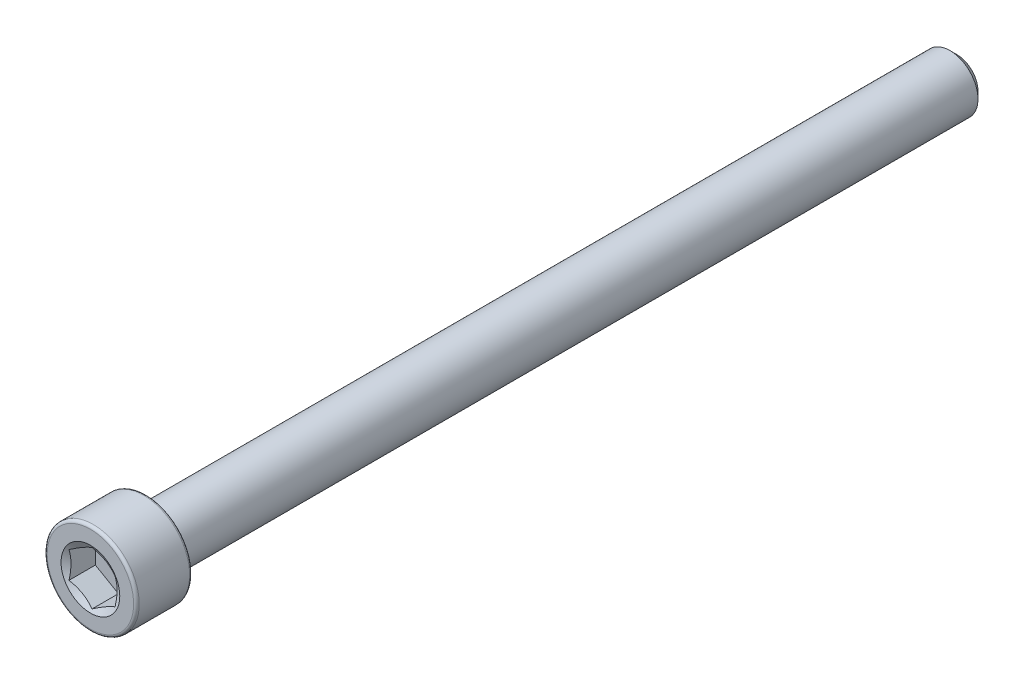
ISO-10303-21;
HEADER;
FILE_DESCRIPTION(('STEP AP214'),'2;1');
FILE_NAME('part.step','',(''),(''),'','','');
FILE_SCHEMA(('AUTOMOTIVE_DESIGN { 1 0 10303 214 1 1 1 1 }'));
ENDSEC;
DATA;
#1=APPLICATION_CONTEXT('core data for automotive mechanical design processes');
#2=APPLICATION_PROTOCOL_DEFINITION('international standard','automotive_design',2000,#1);
#3=PRODUCT_CONTEXT('',#1,'mechanical');
#4=PRODUCT('Part','Part','',(#3));
#5=PRODUCT_RELATED_PRODUCT_CATEGORY('part','',(#4));
#6=PRODUCT_DEFINITION_FORMATION('','',#4);
#7=PRODUCT_DEFINITION_CONTEXT('part definition',#1,'design');
#8=PRODUCT_DEFINITION('design','',#6,#7);
#9=PRODUCT_DEFINITION_SHAPE('','',#8);
#10=(LENGTH_UNIT() NAMED_UNIT(*) SI_UNIT(.MILLI.,.METRE.));
#11=(NAMED_UNIT(*) PLANE_ANGLE_UNIT() SI_UNIT($,.RADIAN.));
#12=(NAMED_UNIT(*) SI_UNIT($,.STERADIAN.) SOLID_ANGLE_UNIT());
#13=UNCERTAINTY_MEASURE_WITH_UNIT(LENGTH_MEASURE(1.E-05),#10,'distance_accuracy_value','');
#14=(GEOMETRIC_REPRESENTATION_CONTEXT(3) GLOBAL_UNCERTAINTY_ASSIGNED_CONTEXT((#13)) GLOBAL_UNIT_ASSIGNED_CONTEXT((#10,
#11,#12)) REPRESENTATION_CONTEXT('',''));
#15=CARTESIAN_POINT('',(0.,0.,0.));
#16=DIRECTION('',(0.,0.,1.));
#17=DIRECTION('',(1.,0.,0.));
#18=AXIS2_PLACEMENT_3D('',#15,#16,#17);
#19=CARTESIAN_POINT('',(0.,0.,-37.338));
#20=DIRECTION('',(0.,0.,-1.));
#21=DIRECTION('',(-1.,0.,0.));
#22=AXIS2_PLACEMENT_3D('',#19,#20,#21);
#23=PLANE('',#22);
#24=CARTESIAN_POINT('',(0.,0.,-37.338));
#25=DIRECTION('',(0.,0.,-1.));
#26=DIRECTION('',(-1.,0.,0.));
#27=AXIS2_PLACEMENT_3D('',#24,#25,#26);
#28=CIRCLE('',#27,1.81768750000002);
#29=CARTESIAN_POINT('',(-1.81768750000002,0.,-37.338));
#30=VERTEX_POINT('',#29);
#31=EDGE_CURVE('E50',#30,#30,#28,.T.);
#32=ORIENTED_EDGE('',*,*,#31,.T.);
#33=EDGE_LOOP('',(#32));
#34=FACE_BOUND('',#33,.T.);
#35=ADVANCED_FACE('F37',(#34),#23,.T.);
#36=CARTESIAN_POINT('',(0.,0.,-37.338));
#37=DIRECTION('',(0.,0.,1.));
#38=DIRECTION('',(1.,0.,0.));
#39=AXIS2_PLACEMENT_3D('',#36,#37,#38);
#40=CONICAL_SURFACE('',#39,1.81768750000002,0.785398163397449);
#41=CARTESIAN_POINT('',(0.,0.,-36.7426875));
#42=DIRECTION('',(0.,0.,-1.));
#43=DIRECTION('',(-1.,0.,0.));
#44=AXIS2_PLACEMENT_3D('',#41,#42,#43);
#45=CIRCLE('',#44,2.41300000000002);
#46=CARTESIAN_POINT('',(-2.41300000000002,0.,-36.7426875));
#47=VERTEX_POINT('',#46);
#48=EDGE_CURVE('E135',#47,#47,#45,.T.);
#49=ORIENTED_EDGE('',*,*,#48,.T.);
#50=EDGE_LOOP('',(#49));
#51=FACE_BOUND('',#50,.T.);
#52=ORIENTED_EDGE('',*,*,#31,.F.);
#53=EDGE_LOOP('',(#52));
#54=FACE_BOUND('',#53,.T.);
#55=ADVANCED_FACE('F141',(#51,#54),#40,.T.);
#56=CARTESIAN_POINT('',(0.,0.,-37.338));
#57=DIRECTION('',(0.,0.,-1.));
#58=DIRECTION('',(-1.,0.,0.));
#59=AXIS2_PLACEMENT_3D('',#56,#57,#58);
#60=CYLINDRICAL_SURFACE('',#59,2.41300000000002);
#61=CARTESIAN_POINT('',(0.,0.,32.512));
#62=DIRECTION('',(0.,0.,-1.));
#63=DIRECTION('',(-1.,0.,0.));
#64=AXIS2_PLACEMENT_3D('',#61,#62,#63);
#65=CIRCLE('',#64,2.41300000000002);
#66=CARTESIAN_POINT('',(-2.41300000000002,0.,32.512));
#67=VERTEX_POINT('',#66);
#68=EDGE_CURVE('E132',#67,#67,#65,.T.);
#69=ORIENTED_EDGE('',*,*,#68,.T.);
#70=EDGE_LOOP('',(#69));
#71=FACE_BOUND('',#70,.T.);
#72=ORIENTED_EDGE('',*,*,#48,.F.);
#73=EDGE_LOOP('',(#72));
#74=FACE_BOUND('',#73,.T.);
#75=ADVANCED_FACE('F143',(#71,#74),#60,.T.);
#76=CARTESIAN_POINT('',(0.,2.413,32.512));
#77=DIRECTION('',(0.,0.,-1.));
#78=DIRECTION('',(-1.,0.,0.));
#79=AXIS2_PLACEMENT_3D('',#76,#77,#78);
#80=PLANE('',#79);
#81=CARTESIAN_POINT('',(0.,0.,32.512));
#82=DIRECTION('',(0.,0.,-1.));
#83=DIRECTION('',(-1.,0.,0.));
#84=AXIS2_PLACEMENT_3D('',#81,#82,#83);
#85=CIRCLE('',#84,3.72745);
#86=CARTESIAN_POINT('',(-3.72745,0.,32.512));
#87=VERTEX_POINT('',#86);
#88=EDGE_CURVE('E129',#87,#87,#85,.T.);
#89=ORIENTED_EDGE('',*,*,#88,.T.);
#90=EDGE_LOOP('',(#89));
#91=FACE_BOUND('',#90,.T.);
#92=ORIENTED_EDGE('',*,*,#68,.F.);
#93=EDGE_LOOP('',(#92));
#94=FACE_BOUND('',#93,.T.);
#95=ADVANCED_FACE('F149',(#91,#94),#80,.T.);
#96=CARTESIAN_POINT('',(0.,0.,32.7533));
#97=DIRECTION('',(0.,0.,-1.));
#98=DIRECTION('',(-1.,0.,0.));
#99=AXIS2_PLACEMENT_3D('',#96,#97,#98);
#100=TOROIDAL_SURFACE('',#99,3.72745,0.241299999999999);
#101=CARTESIAN_POINT('',(0.,0.,32.7533));
#102=DIRECTION('',(0.,0.,-1.));
#103=DIRECTION('',(-1.,0.,0.));
#104=AXIS2_PLACEMENT_3D('',#101,#102,#103);
#105=CIRCLE('',#104,3.96875);
#106=CARTESIAN_POINT('',(-3.96875,0.,32.7533));
#107=VERTEX_POINT('',#106);
#108=EDGE_CURVE('E126',#107,#107,#105,.T.);
#109=ORIENTED_EDGE('',*,*,#108,.T.);
#110=EDGE_LOOP('',(#109));
#111=FACE_BOUND('',#110,.T.);
#112=ORIENTED_EDGE('',*,*,#88,.F.);
#113=EDGE_LOOP('',(#112));
#114=FACE_BOUND('',#113,.T.);
#115=ADVANCED_FACE('F155',(#111,#114),#100,.T.);
#116=CARTESIAN_POINT('',(0.,0.,-37.338));
#117=DIRECTION('',(0.,0.,-1.));
#118=DIRECTION('',(-1.,0.,0.));
#119=AXIS2_PLACEMENT_3D('',#116,#117,#118);
#120=CYLINDRICAL_SURFACE('',#119,3.96875);
#121=CARTESIAN_POINT('',(0.,0.,37.0967));
#122=DIRECTION('',(0.,0.,-1.));
#123=DIRECTION('',(-1.,0.,0.));
#124=AXIS2_PLACEMENT_3D('',#121,#122,#123);
#125=CIRCLE('',#124,3.96875);
#126=CARTESIAN_POINT('',(-3.96875,0.,37.0967));
#127=VERTEX_POINT('',#126);
#128=EDGE_CURVE('E123',#127,#127,#125,.T.);
#129=ORIENTED_EDGE('',*,*,#128,.T.);
#130=EDGE_LOOP('',(#129));
#131=FACE_BOUND('',#130,.T.);
#132=ORIENTED_EDGE('',*,*,#108,.F.);
#133=EDGE_LOOP('',(#132));
#134=FACE_BOUND('',#133,.T.);
#135=ADVANCED_FACE('F159',(#131,#134),#120,.T.);
#136=CARTESIAN_POINT('',(0.,0.,37.0967));
#137=DIRECTION('',(0.,0.,-1.));
#138=DIRECTION('',(-1.,0.,0.));
#139=AXIS2_PLACEMENT_3D('',#136,#137,#138);
#140=TOROIDAL_SURFACE('',#139,3.72745,0.2413);
#141=CARTESIAN_POINT('',(0.,0.,37.338));
#142=DIRECTION('',(0.,0.,-1.));
#143=DIRECTION('',(-1.,0.,0.));
#144=AXIS2_PLACEMENT_3D('',#141,#142,#143);
#145=CIRCLE('',#144,3.72745);
#146=CARTESIAN_POINT('',(-3.72745,0.,37.338));
#147=VERTEX_POINT('',#146);
#148=EDGE_CURVE('E120',#147,#147,#145,.T.);
#149=ORIENTED_EDGE('',*,*,#148,.T.);
#150=EDGE_LOOP('',(#149));
#151=FACE_BOUND('',#150,.T.);
#152=ORIENTED_EDGE('',*,*,#128,.F.);
#153=EDGE_LOOP('',(#152));
#154=FACE_BOUND('',#153,.T.);
#155=ADVANCED_FACE('F163',(#151,#154),#140,.T.);
#156=CARTESIAN_POINT('',(0.,3.72744999999999,37.338));
#157=DIRECTION('',(0.,0.,1.));
#158=DIRECTION('',(1.,0.,0.));
#159=AXIS2_PLACEMENT_3D('',#156,#157,#158);
#160=PLANE('',#159);
#161=CARTESIAN_POINT('',(0.,0.,37.338));
#162=DIRECTION('',(0.,0.,1.));
#163=DIRECTION('',(1.,0.,0.));
#164=AXIS2_PLACEMENT_3D('',#161,#162,#163);
#165=CIRCLE('',#164,2.53070740070526);
#166=CARTESIAN_POINT('',(2.53070740070526,0.,37.338));
#167=VERTEX_POINT('',#166);
#168=EDGE_CURVE('E257',#167,#167,#165,.T.);
#169=ORIENTED_EDGE('',*,*,#168,.F.);
#170=EDGE_LOOP('',(#169));
#171=FACE_BOUND('',#170,.T.);
#172=ORIENTED_EDGE('',*,*,#148,.F.);
#173=EDGE_LOOP('',(#172));
#174=FACE_BOUND('',#173,.T.);
#175=ADVANCED_FACE('F167',(#171,#174),#160,.T.);
#176=CARTESIAN_POINT('',(0.,0.,37.338));
#177=DIRECTION('',(0.,0.,1.));
#178=DIRECTION('',(1.,0.,0.));
#179=AXIS2_PLACEMENT_3D('',#176,#177,#178);
#180=CONICAL_SURFACE('',#179,2.53070740070526,1.0471975511966);
#181=ORIENTED_EDGE('',*,*,#168,.T.);
#182=EDGE_LOOP('',(#181));
#183=FACE_BOUND('',#182,.T.);
#184=CARTESIAN_POINT('',(1.98457499999999,1.14556397036932,37.1998787393351));
#185=CARTESIAN_POINT('',(1.89737036121931,1.19591159204392,37.1707977498695));
#186=CARTESIAN_POINT('',(1.80941298069499,1.24669380936685,37.1443492756564));
#187=CARTESIAN_POINT('',(1.63197502132767,1.34913766297204,37.0981823388358));
#188=CARTESIAN_POINT('',(1.54249128874367,1.4008011200675,37.0784802098783));
#189=CARTESIAN_POINT('',(1.36463285198752,1.50348773640631,37.0478097995608));
#190=CARTESIAN_POINT('',(1.2762855196939,1.55449509248822,37.0366374103495));
#191=CARTESIAN_POINT('',(1.09917497188904,1.65674991493967,37.0232978636837));
#192=CARTESIAN_POINT('',(1.01041240048945,1.70799700943119,37.0211196620894));
#193=CARTESIAN_POINT('',(0.844542697135334,1.80376192731309,37.0256416191377));
#194=CARTESIAN_POINT('',(0.767410784334089,1.848294057932,37.0312314810852));
#195=CARTESIAN_POINT('',(0.613649492810916,1.93706818098385,37.0489510015263));
#196=CARTESIAN_POINT('',(0.537020646254473,1.9813098661709,37.0610867179588));
#197=CARTESIAN_POINT('',(0.382942111493214,2.07026714969166,37.0914262264737));
#198=CARTESIAN_POINT('',(0.305511932787315,2.11497148421091,37.1097586769203));
#199=CARTESIAN_POINT('',(0.15180668875641,2.20371324822801,37.1513665740295));
#200=CARTESIAN_POINT('',(0.0755296529470659,2.24775181538552,37.1746322389117));
#201=CARTESIAN_POINT('',(-0.000200000000001693,2.29147435090015,37.1998787393351));
#202=B_SPLINE_CURVE_WITH_KNOTS('',3,(#184,#185,#186,#187,#188,#189,#190,#191,#192,#193,#194,
#195,#196,#197,#198,#199,#200,#201),.UNSPECIFIED.,.F.,.F.,(4,2,2,2,2,2,2,2,4),(0.,
0.314555137114083,0.629866549668801,0.937373439505926,1.24450262309397,1.51196650590477,
1.77967834211413,2.05332989762154,2.32644383656792),.UNSPECIFIED.);
#203=CARTESIAN_POINT('',(1.98437499999999,1.14567944042315,37.1998120676293));
#204=VERTEX_POINT('',#203);
#205=CARTESIAN_POINT('',(0.,2.29135888084631,37.1998120676293));
#206=VERTEX_POINT('',#205);
#207=EDGE_CURVE('E104',#204,#206,#202,.T.);
#208=ORIENTED_EDGE('',*,*,#207,.F.);
#209=CARTESIAN_POINT('',(1.98437499999999,-3.00026729742339,37.9536996764954));
#210=CARTESIAN_POINT('',(1.98437499999999,-2.91417852714617,37.9122554995199));
#211=CARTESIAN_POINT('',(1.98437499999999,-2.82788354366182,37.8712318701391));
#212=CARTESIAN_POINT('',(1.98437499999999,-2.65477109089712,37.7902640719882));
#213=CARTESIAN_POINT('',(1.98437499999999,-2.56795353399494,37.7503200907809));
#214=CARTESIAN_POINT('',(1.98437499999999,-2.39320060303682,37.6715322756389));
#215=CARTESIAN_POINT('',(1.98437499999999,-2.30526165499614,37.6326963397322));
#216=CARTESIAN_POINT('',(1.98437499999999,-2.12865626167958,37.5567217534969));
#217=CARTESIAN_POINT('',(1.98437499999999,-2.0399898536152,37.5195830169827));
#218=CARTESIAN_POINT('',(1.98437499999999,-1.85931319770472,37.4464519444036));
#219=CARTESIAN_POINT('',(1.98437499999999,-1.76727839255488,37.4105199296325));
#220=CARTESIAN_POINT('',(1.98437499999999,-1.5821041626652,37.3415670586381));
#221=CARTESIAN_POINT('',(1.98437499999999,-1.48896461158262,37.3085465390977));
#222=CARTESIAN_POINT('',(1.98437499999999,-1.30163731722862,37.2463414082388));
#223=CARTESIAN_POINT('',(1.98437499999999,-1.20745247053434,37.217148166413));
#224=CARTESIAN_POINT('',(1.98437499999999,-1.0177273513406,37.1635801299636));
#225=CARTESIAN_POINT('',(1.98437499999999,-0.922187418803864,37.1392041489301));
#226=CARTESIAN_POINT('',(1.98437499999999,-0.730187774437195,37.0966100252547));
#227=CARTESIAN_POINT('',(1.98437499999999,-0.633734462555378,37.0783635885809));
#228=CARTESIAN_POINT('',(1.98437499999999,-0.43971527635355,37.0491213033277));
#229=CARTESIAN_POINT('',(1.98437499999999,-0.342149489314397,37.038124889865));
#230=CARTESIAN_POINT('',(1.98437499999999,-0.147628044199054,37.0244070417718));
#231=CARTESIAN_POINT('',(1.98437499999999,-0.0506796597421213,37.0215854104354));
#232=CARTESIAN_POINT('',(1.98437499999999,0.143103115571664,37.024185514727));
#233=CARTESIAN_POINT('',(1.98437499999999,0.239937499827365,37.0296077062766));
#234=CARTESIAN_POINT('',(1.98437499999999,0.476970423936259,37.0524923549886));
#235=CARTESIAN_POINT('',(1.98437499999999,0.616748292390848,37.0743270404436));
#236=CARTESIAN_POINT('',(1.98437499999999,0.89360792888452,37.1311402077941));
#237=CARTESIAN_POINT('',(1.98437499999999,1.03068676882901,37.1661322170173));
#238=CARTESIAN_POINT('',(1.98437499999999,1.30511969999724,37.2464152230234));
#239=CARTESIAN_POINT('',(1.98437499999999,1.44240893450287,37.2919226619543));
#240=CARTESIAN_POINT('',(1.98437499999999,1.64644508842434,37.3652634246735));
#241=CARTESIAN_POINT('',(1.98437499999999,1.71413212999321,37.3905533074583));
#242=CARTESIAN_POINT('',(1.98437499999999,1.84895802350132,37.4425549515399));
#243=CARTESIAN_POINT('',(1.98437499999999,1.91609688529706,37.4692666872059));
#244=CARTESIAN_POINT('',(1.98437499999999,2.09043183263474,37.5404120267758));
#245=CARTESIAN_POINT('',(1.98437499999999,2.19724734382523,37.5857757687467));
#246=CARTESIAN_POINT('',(1.98437499999999,2.40988153193629,37.6787895460846));
#247=CARTESIAN_POINT('',(1.98437499999999,2.51570012860561,37.7264397636623));
#248=CARTESIAN_POINT('',(1.98437499999999,2.72655852247189,37.8235005052356));
#249=CARTESIAN_POINT('',(1.98437499999999,2.83159810540153,37.8729114933103));
#250=CARTESIAN_POINT('',(1.98437499999999,3.04102680140026,37.9730954913632));
#251=CARTESIAN_POINT('',(1.98437499999999,3.14541589892037,38.0238685337466));
#252=CARTESIAN_POINT('',(1.98437499999999,3.45805934392728,38.1779112385608));
#253=CARTESIAN_POINT('',(1.98437499999999,3.66552471194404,38.2827805102459));
#254=CARTESIAN_POINT('',(1.98437499999999,4.07900502507438,38.4952421528608));
#255=CARTESIAN_POINT('',(1.98437499999999,4.28502019488324,38.6028340895145));
#256=CARTESIAN_POINT('',(1.98437499999999,4.67597606585553,38.8092945522279));
#257=CARTESIAN_POINT('',(1.98437499999999,4.8610092056076,38.9079883192138));
#258=CARTESIAN_POINT('',(1.98437499999999,5.23047989061984,39.106503421698));
#259=CARTESIAN_POINT('',(1.98437499999999,5.41491740749766,39.2063248099387));
#260=CARTESIAN_POINT('',(1.98437499999999,5.78283314119707,39.4065376967861));
#261=CARTESIAN_POINT('',(1.98437499999999,5.9663126029318,39.5069269102676));
#262=CARTESIAN_POINT('',(1.98437499999999,6.33289930192253,39.7083559236772));
#263=CARTESIAN_POINT('',(1.98437499999999,6.51600656168198,39.8093956826348));
#264=CARTESIAN_POINT('',(1.98437499999999,6.69898126466818,39.9106733706002));
#265=B_SPLINE_CURVE_WITH_KNOTS('',3,(#209,#210,#211,#212,#213,#214,#215,#216,#217,#218,#219,
#220,#221,#222,#223,#224,#225,#226,#227,#228,#229,#230,#231,#232,#233,#234,#235,#236,#237,#238,
#239,#240,#241,#242,#243,#244,#245,#246,#247,#248,#249,#250,#251,#252,#253,#254,#255,#256,#257,
#258,#259,#260,#261,#262,#263,#264),.UNSPECIFIED.,.F.,.F.,(4,2,2,2,2,2,2,2,2,2,2,2,2,2,2,2,2,2,
2,2,2,2,2,2,2,2,2,4),(0.,0.286639682230866,0.573328845206276,0.861712521680994,1.1500815374161,
1.44644465754249,1.74284200403622,2.03855903673007,2.33420314830459,2.62846318470745,
2.92270029122631,3.21331540991077,3.50394660154196,3.9274884183087,4.35146688350434,
4.78510306957839,5.001864482484,5.21862198930868,5.56673163285503,5.91486906368416,
6.26309894038445,6.61133710935788,7.30869129939498,8.0059349511209,8.63505562775266,
9.26420585322011,9.89164710445791,10.5190492194134),.UNSPECIFIED.);
#266=CARTESIAN_POINT('',(1.98437499999999,-1.14567944042316,37.1998120676293));
#267=VERTEX_POINT('',#266);
#268=EDGE_CURVE('E213',#267,#204,#265,.T.);
#269=ORIENTED_EDGE('',*,*,#268,.F.);
#270=CARTESIAN_POINT('',(-0.000200000000001244,-2.29147435090015,37.1998787393351));
#271=CARTESIAN_POINT('',(0.0870046387806752,-2.24112672922554,37.1707977498695));
#272=CARTESIAN_POINT('',(0.174962019304995,-2.19034451190261,37.1443492756564));
#273=CARTESIAN_POINT('',(0.352399978672317,-2.08790065829743,37.0981823388358));
#274=CARTESIAN_POINT('',(0.441883711256315,-2.03623720120197,37.0784802098783));
#275=CARTESIAN_POINT('',(0.619742148012463,-1.93355058486316,37.0478097995608));
#276=CARTESIAN_POINT('',(0.708089480306086,-1.88254322878125,37.0366374103495));
#277=CARTESIAN_POINT('',(0.885200028110941,-1.78028840632979,37.0232978636837));
#278=CARTESIAN_POINT('',(0.973962599510538,-1.72904131183827,37.0211196620894));
#279=CARTESIAN_POINT('',(1.13983230286465,-1.63327639395637,37.0256416191377));
#280=CARTESIAN_POINT('',(1.2169642156659,-1.58874426333746,37.0312314810852));
#281=CARTESIAN_POINT('',(1.37072550718907,-1.49997014028562,37.0489510015263));
#282=CARTESIAN_POINT('',(1.44735435374551,-1.45572845509856,37.0610867179588));
#283=CARTESIAN_POINT('',(1.60143288850677,-1.36677117157781,37.0914262264737));
#284=CARTESIAN_POINT('',(1.67886306721267,-1.32206683705856,37.1097586769203));
#285=CARTESIAN_POINT('',(1.83256831124358,-1.23332507304145,37.1513665740295));
#286=CARTESIAN_POINT('',(1.90884534705292,-1.18928650588394,37.1746322389117));
#287=CARTESIAN_POINT('',(1.98457499999999,-1.14556397036932,37.1998787393351));
#288=B_SPLINE_CURVE_WITH_KNOTS('',3,(#270,#271,#272,#273,#274,#275,#276,#277,#278,#279,#280,
#281,#282,#283,#284,#285,#286,#287),.UNSPECIFIED.,.F.,.F.,(4,2,2,2,2,2,2,2,4),(0.,
0.314555137114083,0.629866549668801,0.937373439505925,1.24450262309397,1.51196650590477,
1.77967834211413,2.05332989762153,2.32644383656792),.UNSPECIFIED.);
#289=CARTESIAN_POINT('',(0.,-2.29135888084631,37.1998120676293));
#290=VERTEX_POINT('',#289);
#291=EDGE_CURVE('E207',#290,#267,#288,.T.);
#292=ORIENTED_EDGE('',*,*,#291,.F.);
#293=CARTESIAN_POINT('',(-1.98457499999999,-1.14556397036932,37.1998787393351));
#294=CARTESIAN_POINT('',(-1.89737036121931,-1.19591159204393,37.1707977498695));
#295=CARTESIAN_POINT('',(-1.80941298069499,-1.24669380936686,37.1443492756564));
#296=CARTESIAN_POINT('',(-1.63197502132767,-1.34913766297204,37.0981823388358));
#297=CARTESIAN_POINT('',(-1.54249128874367,-1.4008011200675,37.0784802098783));
#298=CARTESIAN_POINT('',(-1.36463285198752,-1.50348773640631,37.0478097995608));
#299=CARTESIAN_POINT('',(-1.2762855196939,-1.55449509248822,37.0366374103495));
#300=CARTESIAN_POINT('',(-1.09917497188905,-1.65674991493967,37.0232978636837));
#301=CARTESIAN_POINT('',(-1.01041240048945,-1.70799700943119,37.0211196620894));
#302=CARTESIAN_POINT('',(-0.844542697135335,-1.80376192731309,37.0256416191377));
#303=CARTESIAN_POINT('',(-0.767410784334091,-1.848294057932,37.0312314810852));
#304=CARTESIAN_POINT('',(-0.613649492810918,-1.93706818098385,37.0489510015263));
#305=CARTESIAN_POINT('',(-0.537020646254475,-1.9813098661709,37.0610867179588));
#306=CARTESIAN_POINT('',(-0.382942111493216,-2.07026714969166,37.0914262264737));
#307=CARTESIAN_POINT('',(-0.305511932787317,-2.11497148421091,37.1097586769203));
#308=CARTESIAN_POINT('',(-0.151806688756412,-2.20371324822801,37.1513665740295));
#309=CARTESIAN_POINT('',(-0.0755296529470689,-2.24775181538552,37.1746322389117));
#310=CARTESIAN_POINT('',(0.000199999999998837,-2.29147435090015,37.1998787393351));
#311=B_SPLINE_CURVE_WITH_KNOTS('',3,(#293,#294,#295,#296,#297,#298,#299,#300,#301,#302,#303,
#304,#305,#306,#307,#308,#309,#310),.UNSPECIFIED.,.F.,.F.,(4,2,2,2,2,2,2,2,4),(0.,
0.314555137114084,0.629866549668801,0.937373439505925,1.24450262309397,1.51196650590477,
1.77967834211413,2.05332989762153,2.32644383656792),.UNSPECIFIED.);
#312=CARTESIAN_POINT('',(-1.98437499999999,-1.14567944042316,37.1998120676293));
#313=VERTEX_POINT('',#312);
#314=EDGE_CURVE('E57',#313,#290,#311,.T.);
#315=ORIENTED_EDGE('',*,*,#314,.F.);
#316=CARTESIAN_POINT('',(-1.98437499999999,-3.00026729742339,37.9536996764954));
#317=CARTESIAN_POINT('',(-1.98437499999999,-2.91417852714617,37.9122554995199));
#318=CARTESIAN_POINT('',(-1.98437499999999,-2.82788354366182,37.8712318701391));
#319=CARTESIAN_POINT('',(-1.98437499999999,-2.65477109089712,37.7902640719882));
#320=CARTESIAN_POINT('',(-1.98437499999999,-2.56795353399494,37.7503200907809));
#321=CARTESIAN_POINT('',(-1.98437499999999,-2.39320060303682,37.6715322756389));
#322=CARTESIAN_POINT('',(-1.98437499999999,-2.30526165499614,37.6326963397322));
#323=CARTESIAN_POINT('',(-1.98437499999999,-2.12865626167958,37.5567217534969));
#324=CARTESIAN_POINT('',(-1.98437499999999,-2.0399898536152,37.5195830169827));
#325=CARTESIAN_POINT('',(-1.98437499999999,-1.85931319770472,37.4464519444036));
#326=CARTESIAN_POINT('',(-1.98437499999999,-1.76727839255488,37.4105199296325));
#327=CARTESIAN_POINT('',(-1.98437499999999,-1.5821041626652,37.3415670586381));
#328=CARTESIAN_POINT('',(-1.98437499999999,-1.48896461158262,37.3085465390977));
#329=CARTESIAN_POINT('',(-1.98437499999999,-1.30163731722862,37.2463414082388));
#330=CARTESIAN_POINT('',(-1.98437499999999,-1.20745247053434,37.217148166413));
#331=CARTESIAN_POINT('',(-1.98437499999999,-1.0177273513406,37.1635801299636));
#332=CARTESIAN_POINT('',(-1.98437499999999,-0.922187418803864,37.1392041489301));
#333=CARTESIAN_POINT('',(-1.98437499999999,-0.730187774437195,37.0966100252547));
#334=CARTESIAN_POINT('',(-1.98437499999999,-0.633734462555379,37.0783635885809));
#335=CARTESIAN_POINT('',(-1.98437499999999,-0.43971527635355,37.0491213033277));
#336=CARTESIAN_POINT('',(-1.98437499999999,-0.342149489314398,37.038124889865));
#337=CARTESIAN_POINT('',(-1.98437499999999,-0.147628044199054,37.0244070417718));
#338=CARTESIAN_POINT('',(-1.98437499999999,-0.0506796597421213,37.0215854104354));
#339=CARTESIAN_POINT('',(-1.98437499999999,0.143103115571664,37.024185514727));
#340=CARTESIAN_POINT('',(-1.98437499999999,0.239937499827365,37.0296077062766));
#341=CARTESIAN_POINT('',(-1.98437499999999,0.476970423936257,37.0524923549886));
#342=CARTESIAN_POINT('',(-1.98437499999999,0.616748292390846,37.0743270404436));
#343=CARTESIAN_POINT('',(-1.98437499999999,0.893607928884516,37.1311402077941));
#344=CARTESIAN_POINT('',(-1.98437499999999,1.030686768829,37.1661322170173));
#345=CARTESIAN_POINT('',(-1.98437499999999,1.30511969999723,37.2464152230234));
#346=CARTESIAN_POINT('',(-1.98437499999999,1.44240893450287,37.2919226619543));
#347=CARTESIAN_POINT('',(-1.98437499999999,1.64644508842434,37.3652634246735));
#348=CARTESIAN_POINT('',(-1.98437499999999,1.71413212999321,37.3905533074583));
#349=CARTESIAN_POINT('',(-1.98437499999999,1.84895802350132,37.4425549515399));
#350=CARTESIAN_POINT('',(-1.98437499999999,1.91609688529705,37.4692666872059));
#351=CARTESIAN_POINT('',(-1.98437499999999,2.09043183263474,37.5404120267758));
#352=CARTESIAN_POINT('',(-1.98437499999999,2.19724734382523,37.5857757687467));
#353=CARTESIAN_POINT('',(-1.98437499999999,2.4098815319363,37.6787895460846));
#354=CARTESIAN_POINT('',(-1.98437499999999,2.51570012860561,37.7264397636623));
#355=CARTESIAN_POINT('',(-1.98437499999999,2.7265585224719,37.8235005052356));
#356=CARTESIAN_POINT('',(-1.98437499999999,2.83159810540154,37.8729114933103));
#357=CARTESIAN_POINT('',(-1.98437499999999,3.04102680140026,37.9730954913632));
#358=CARTESIAN_POINT('',(-1.98437499999999,3.14541589892037,38.0238685337466));
#359=CARTESIAN_POINT('',(-1.98437499999999,3.45805934392728,38.1779112385608));
#360=CARTESIAN_POINT('',(-1.98437499999999,3.66552471194404,38.2827805102459));
#361=CARTESIAN_POINT('',(-1.98437499999999,4.07900502507438,38.4952421528608));
#362=CARTESIAN_POINT('',(-1.98437499999999,4.28502019488324,38.6028340895145));
#363=CARTESIAN_POINT('',(-1.98437499999999,4.67597606585553,38.8092945522279));
#364=CARTESIAN_POINT('',(-1.98437499999999,4.8610092056076,38.9079883192138));
#365=CARTESIAN_POINT('',(-1.98437499999999,5.23047989061985,39.106503421698));
#366=CARTESIAN_POINT('',(-1.98437499999999,5.41491740749766,39.2063248099387));
#367=CARTESIAN_POINT('',(-1.98437499999999,5.78283314119707,39.4065376967861));
#368=CARTESIAN_POINT('',(-1.98437499999999,5.9663126029318,39.5069269102676));
#369=CARTESIAN_POINT('',(-1.98437499999999,6.33289930192254,39.7083559236772));
#370=CARTESIAN_POINT('',(-1.98437499999999,6.51600656168199,39.8093956826348));
#371=CARTESIAN_POINT('',(-1.98437499999999,6.69898126466818,39.9106733706002));
#372=B_SPLINE_CURVE_WITH_KNOTS('',3,(#316,#317,#318,#319,#320,#321,#322,#323,#324,#325,#326,
#327,#328,#329,#330,#331,#332,#333,#334,#335,#336,#337,#338,#339,#340,#341,#342,#343,#344,#345,
#346,#347,#348,#349,#350,#351,#352,#353,#354,#355,#356,#357,#358,#359,#360,#361,#362,#363,#364,
#365,#366,#367,#368,#369,#370,#371),.UNSPECIFIED.,.F.,.F.,(4,2,2,2,2,2,2,2,2,2,2,2,2,2,2,2,2,2,
2,2,2,2,2,2,2,2,2,4),(0.,0.286639682230865,0.573328845206275,0.861712521680993,1.1500815374161,
1.44644465754249,1.74284200403622,2.03855903673007,2.33420314830459,2.62846318470744,
2.92270029122631,3.21331540991077,3.50394660154196,3.9274884183087,4.35146688350433,
4.78510306957839,5.00186448248399,5.21862198930868,5.56673163285503,5.91486906368416,
6.26309894038446,6.61133710935788,7.30869129939498,8.00593495112091,8.63505562775266,
9.26420585322011,9.89164710445791,10.5190492194133),.UNSPECIFIED.);
#373=CARTESIAN_POINT('',(-1.98437499999999,1.14567944042316,37.1998120676293));
#374=VERTEX_POINT('',#373);
#375=EDGE_CURVE('E11',#374,#313,#372,.F.);
#376=ORIENTED_EDGE('',*,*,#375,.F.);
#377=CARTESIAN_POINT('',(0.00019999999999772,2.29147435090015,37.1998787393351));
#378=CARTESIAN_POINT('',(-0.0870046387806788,2.24112672922554,37.1707977498695));
#379=CARTESIAN_POINT('',(-0.174962019304998,2.19034451190261,37.1443492756564));
#380=CARTESIAN_POINT('',(-0.35239997867232,2.08790065829743,37.0981823388358));
#381=CARTESIAN_POINT('',(-0.441883711256318,2.03623720120197,37.0784802098783));
#382=CARTESIAN_POINT('',(-0.619742148012466,1.93355058486316,37.0478097995608));
#383=CARTESIAN_POINT('',(-0.70808948030609,1.88254322878125,37.0366374103495));
#384=CARTESIAN_POINT('',(-0.885200028110944,1.78028840632979,37.0232978636837));
#385=CARTESIAN_POINT('',(-0.973962599510541,1.72904131183827,37.0211196620894));
#386=CARTESIAN_POINT('',(-1.13983230286465,1.63327639395637,37.0256416191377));
#387=CARTESIAN_POINT('',(-1.2169642156659,1.58874426333746,37.0312314810852));
#388=CARTESIAN_POINT('',(-1.37072550718907,1.49997014028562,37.0489510015263));
#389=CARTESIAN_POINT('',(-1.44735435374551,1.45572845509856,37.0610867179588));
#390=CARTESIAN_POINT('',(-1.60143288850677,1.36677117157781,37.0914262264737));
#391=CARTESIAN_POINT('',(-1.67886306721267,1.32206683705856,37.1097586769203));
#392=CARTESIAN_POINT('',(-1.83256831124358,1.23332507304146,37.1513665740295));
#393=CARTESIAN_POINT('',(-1.90884534705292,1.18928650588394,37.1746322389117));
#394=CARTESIAN_POINT('',(-1.98457499999999,1.14556397036932,37.1998787393351));
#395=B_SPLINE_CURVE_WITH_KNOTS('',3,(#377,#378,#379,#380,#381,#382,#383,#384,#385,#386,#387,
#388,#389,#390,#391,#392,#393,#394),.UNSPECIFIED.,.F.,.F.,(4,2,2,2,2,2,2,2,4),(0.,
0.314555137114083,0.629866549668801,0.937373439505925,1.24450262309397,1.51196650590477,
1.77967834211413,2.05332989762153,2.32644383656791),.UNSPECIFIED.);
#396=EDGE_CURVE('E95',#206,#374,#395,.T.);
#397=ORIENTED_EDGE('',*,*,#396,.F.);
#398=EDGE_LOOP('',(#208,#269,#292,#315,#376,#397));
#399=FACE_BOUND('',#398,.T.);
#400=ADVANCED_FACE('F94',(#183,#399),#180,.F.);
#401=CARTESIAN_POINT('',(0.,0.,34.925));
#402=DIRECTION('',(0.,0.,1.));
#403=DIRECTION('',(1.,0.,0.));
#404=AXIS2_PLACEMENT_3D('',#401,#402,#403);
#405=PLANE('',#404);
#406=DIRECTION('',(-0.866025403784438,-0.5,0.));
#407=VECTOR('',#406,1.);
#408=CARTESIAN_POINT('',(0.,2.29135888084631,34.925));
#409=LINE('',#408,#407);
#410=CARTESIAN_POINT('',(0.,2.29135888084631,34.925));
#411=VERTEX_POINT('',#410);
#412=CARTESIAN_POINT('',(-1.98437499999999,1.14567944042316,34.925));
#413=VERTEX_POINT('',#412);
#414=EDGE_CURVE('E103',#411,#413,#409,.T.);
#415=ORIENTED_EDGE('',*,*,#414,.T.);
#416=DIRECTION('',(0.,-1.,0.));
#417=VECTOR('',#416,1.);
#418=CARTESIAN_POINT('',(-1.98437499999999,1.14567944042316,34.925));
#419=LINE('',#418,#417);
#420=CARTESIAN_POINT('',(-1.98437499999999,-1.14567944042316,34.925));
#421=VERTEX_POINT('',#420);
#422=EDGE_CURVE('E108',#413,#421,#419,.T.);
#423=ORIENTED_EDGE('',*,*,#422,.T.);
#424=DIRECTION('',(0.866025403784439,-0.5,0.));
#425=VECTOR('',#424,1.);
#426=CARTESIAN_POINT('',(-1.98437499999999,-1.14567944042316,34.925));
#427=LINE('',#426,#425);
#428=CARTESIAN_POINT('',(0.,-2.29135888084631,34.925));
#429=VERTEX_POINT('',#428);
#430=EDGE_CURVE('E239',#421,#429,#427,.T.);
#431=ORIENTED_EDGE('',*,*,#430,.T.);
#432=DIRECTION('',(0.866025403784439,0.5,0.));
#433=VECTOR('',#432,1.);
#434=CARTESIAN_POINT('',(0.,-2.29135888084631,34.925));
#435=LINE('',#434,#433);
#436=CARTESIAN_POINT('',(1.98437499999999,-1.14567944042316,34.925));
#437=VERTEX_POINT('',#436);
#438=EDGE_CURVE('E243',#429,#437,#435,.T.);
#439=ORIENTED_EDGE('',*,*,#438,.T.);
#440=DIRECTION('',(0.,1.,0.));
#441=VECTOR('',#440,1.);
#442=CARTESIAN_POINT('',(1.98437499999999,-1.14567944042316,34.925));
#443=LINE('',#442,#441);
#444=CARTESIAN_POINT('',(1.98437499999999,1.14567944042315,34.925));
#445=VERTEX_POINT('',#444);
#446=EDGE_CURVE('E116',#437,#445,#443,.T.);
#447=ORIENTED_EDGE('',*,*,#446,.T.);
#448=DIRECTION('',(-0.866025403784438,0.5,0.));
#449=VECTOR('',#448,1.);
#450=CARTESIAN_POINT('',(1.98437499999999,1.14567944042315,34.925));
#451=LINE('',#450,#449);
#452=EDGE_CURVE('E111',#445,#411,#451,.T.);
#453=ORIENTED_EDGE('',*,*,#452,.T.);
#454=EDGE_LOOP('',(#415,#423,#431,#439,#447,#453));
#455=FACE_BOUND('',#454,.T.);
#456=ADVANCED_FACE('F193',(#455),#405,.T.);
#457=CARTESIAN_POINT('',(-1.98437499999999,1.14567944042316,34.925));
#458=DIRECTION('',(-1.,0.,0.));
#459=DIRECTION('',(0.,0.,1.));
#460=AXIS2_PLACEMENT_3D('',#457,#458,#459);
#461=PLANE('',#460);
#462=DIRECTION('',(0.,0.,1.));
#463=VECTOR('',#462,1.);
#464=CARTESIAN_POINT('',(-1.98437499999999,1.14567944042316,34.925));
#465=LINE('',#464,#463);
#466=EDGE_CURVE('E101',#413,#374,#465,.T.);
#467=ORIENTED_EDGE('',*,*,#466,.T.);
#468=ORIENTED_EDGE('',*,*,#375,.T.);
#469=DIRECTION('',(0.,0.,1.));
#470=VECTOR('',#469,1.);
#471=CARTESIAN_POINT('',(-1.98437499999999,-1.14567944042316,34.925));
#472=LINE('',#471,#470);
#473=EDGE_CURVE('E110',#421,#313,#472,.T.);
#474=ORIENTED_EDGE('',*,*,#473,.F.);
#475=ORIENTED_EDGE('',*,*,#422,.F.);
#476=EDGE_LOOP('',(#467,#468,#474,#475));
#477=FACE_BOUND('',#476,.T.);
#478=ADVANCED_FACE('F106',(#477),#461,.F.);
#479=CARTESIAN_POINT('',(-1.98437499999999,-1.14567944042316,34.925));
#480=DIRECTION('',(-0.5,-0.866025403784439,0.));
#481=DIRECTION('',(0.866025403784439,-0.5,0.));
#482=AXIS2_PLACEMENT_3D('',#479,#480,#481);
#483=PLANE('',#482);
#484=ORIENTED_EDGE('',*,*,#473,.T.);
#485=ORIENTED_EDGE('',*,*,#314,.T.);
#486=DIRECTION('',(0.,0.,1.));
#487=VECTOR('',#486,1.);
#488=CARTESIAN_POINT('',(0.,-2.29135888084631,34.925));
#489=LINE('',#488,#487);
#490=EDGE_CURVE('E113',#429,#290,#489,.T.);
#491=ORIENTED_EDGE('',*,*,#490,.F.);
#492=ORIENTED_EDGE('',*,*,#430,.F.);
#493=EDGE_LOOP('',(#484,#485,#491,#492));
#494=FACE_BOUND('',#493,.T.);
#495=ADVANCED_FACE('F228',(#494),#483,.F.);
#496=CARTESIAN_POINT('',(0.,-2.29135888084631,34.925));
#497=DIRECTION('',(0.5,-0.866025403784439,0.));
#498=DIRECTION('',(0.866025403784439,0.5,0.));
#499=AXIS2_PLACEMENT_3D('',#496,#497,#498);
#500=PLANE('',#499);
#501=ORIENTED_EDGE('',*,*,#490,.T.);
#502=ORIENTED_EDGE('',*,*,#291,.T.);
#503=DIRECTION('',(0.,0.,1.));
#504=VECTOR('',#503,1.);
#505=CARTESIAN_POINT('',(1.98437499999999,-1.14567944042316,34.925));
#506=LINE('',#505,#504);
#507=EDGE_CURVE('E253',#437,#267,#506,.T.);
#508=ORIENTED_EDGE('',*,*,#507,.F.);
#509=ORIENTED_EDGE('',*,*,#438,.F.);
#510=EDGE_LOOP('',(#501,#502,#508,#509));
#511=FACE_BOUND('',#510,.T.);
#512=ADVANCED_FACE('F223',(#511),#500,.F.);
#513=CARTESIAN_POINT('',(1.98437499999999,-1.14567944042316,34.925));
#514=DIRECTION('',(1.,0.,0.));
#515=DIRECTION('',(0.,1.,0.));
#516=AXIS2_PLACEMENT_3D('',#513,#514,#515);
#517=PLANE('',#516);
#518=ORIENTED_EDGE('',*,*,#507,.T.);
#519=ORIENTED_EDGE('',*,*,#268,.T.);
#520=DIRECTION('',(0.,0.,1.));
#521=VECTOR('',#520,1.);
#522=CARTESIAN_POINT('',(1.98437499999999,1.14567944042315,34.925));
#523=LINE('',#522,#521);
#524=EDGE_CURVE('E250',#445,#204,#523,.T.);
#525=ORIENTED_EDGE('',*,*,#524,.F.);
#526=ORIENTED_EDGE('',*,*,#446,.F.);
#527=EDGE_LOOP('',(#518,#519,#525,#526));
#528=FACE_BOUND('',#527,.T.);
#529=ADVANCED_FACE('F220',(#528),#517,.F.);
#530=CARTESIAN_POINT('',(1.98437499999999,1.14567944042315,34.925));
#531=DIRECTION('',(0.5,0.866025403784439,0.));
#532=DIRECTION('',(-0.866025403784439,0.5,0.));
#533=AXIS2_PLACEMENT_3D('',#530,#531,#532);
#534=PLANE('',#533);
#535=ORIENTED_EDGE('',*,*,#524,.T.);
#536=ORIENTED_EDGE('',*,*,#207,.T.);
#537=DIRECTION('',(0.,0.,1.));
#538=VECTOR('',#537,1.);
#539=CARTESIAN_POINT('',(0.,2.29135888084631,34.925));
#540=LINE('',#539,#538);
#541=EDGE_CURVE('E64',#411,#206,#540,.T.);
#542=ORIENTED_EDGE('',*,*,#541,.F.);
#543=ORIENTED_EDGE('',*,*,#452,.F.);
#544=EDGE_LOOP('',(#535,#536,#542,#543));
#545=FACE_BOUND('',#544,.T.);
#546=ADVANCED_FACE('F174',(#545),#534,.F.);
#547=CARTESIAN_POINT('',(0.,2.29135888084631,34.925));
#548=DIRECTION('',(-0.5,0.866025403784438,0.));
#549=DIRECTION('',(-0.866025403784438,-0.5,0.));
#550=AXIS2_PLACEMENT_3D('',#547,#548,#549);
#551=PLANE('',#550);
#552=ORIENTED_EDGE('',*,*,#541,.T.);
#553=ORIENTED_EDGE('',*,*,#396,.T.);
#554=ORIENTED_EDGE('',*,*,#466,.F.);
#555=ORIENTED_EDGE('',*,*,#414,.F.);
#556=EDGE_LOOP('',(#552,#553,#554,#555));
#557=FACE_BOUND('',#556,.T.);
#558=ADVANCED_FACE('F100',(#557),#551,.F.);
#559=CLOSED_SHELL('',(#35,#55,#75,#95,#115,#135,#155,#175,#400,#456,#478,#495,#512,#529,#546,#558));
#560=MANIFOLD_SOLID_BREP('B2',#559);
#561=ADVANCED_BREP_SHAPE_REPRESENTATION('',(#18,#560),#14);
#562=SHAPE_DEFINITION_REPRESENTATION(#9,#561);
ENDSEC;
END-ISO-10303-21;
